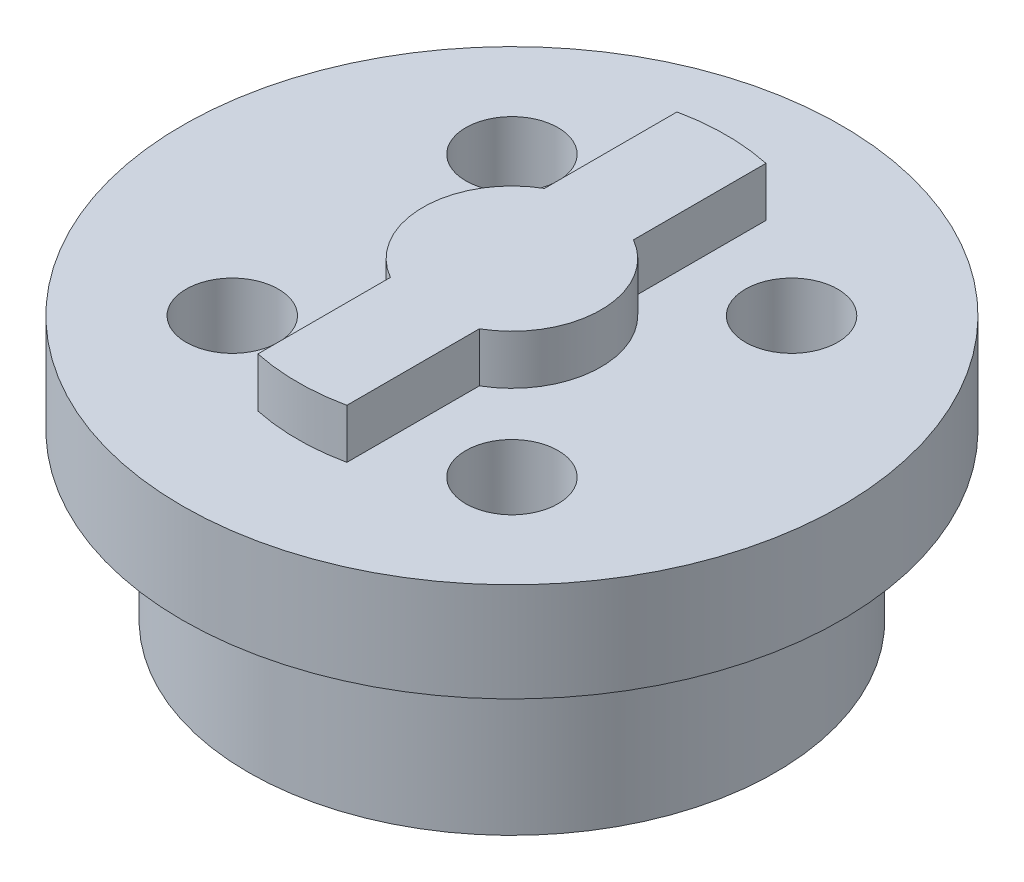
ISO-10303-21;
HEADER;
FILE_DESCRIPTION(('STEP AP214'),'2;1');
FILE_NAME('part.step','',(''),(''),'','','');
FILE_SCHEMA(('AUTOMOTIVE_DESIGN { 1 0 10303 214 1 1 1 1 }'));
ENDSEC;
DATA;
#1=APPLICATION_CONTEXT('core data for automotive mechanical design processes');
#2=APPLICATION_PROTOCOL_DEFINITION('international standard','automotive_design',2000,#1);
#3=PRODUCT_CONTEXT('',#1,'mechanical');
#4=PRODUCT('Part','Part','',(#3));
#5=PRODUCT_RELATED_PRODUCT_CATEGORY('part','',(#4));
#6=PRODUCT_DEFINITION_FORMATION('','',#4);
#7=PRODUCT_DEFINITION_CONTEXT('part definition',#1,'design');
#8=PRODUCT_DEFINITION('design','',#6,#7);
#9=PRODUCT_DEFINITION_SHAPE('','',#8);
#10=(LENGTH_UNIT() NAMED_UNIT(*) SI_UNIT(.MILLI.,.METRE.));
#11=(NAMED_UNIT(*) PLANE_ANGLE_UNIT() SI_UNIT($,.RADIAN.));
#12=(NAMED_UNIT(*) SI_UNIT($,.STERADIAN.) SOLID_ANGLE_UNIT());
#13=UNCERTAINTY_MEASURE_WITH_UNIT(LENGTH_MEASURE(1.E-05),#10,'distance_accuracy_value','');
#14=(GEOMETRIC_REPRESENTATION_CONTEXT(3) GLOBAL_UNCERTAINTY_ASSIGNED_CONTEXT((#13)) GLOBAL_UNIT_ASSIGNED_CONTEXT((#10,
#11,#12)) REPRESENTATION_CONTEXT('',''));
#15=CARTESIAN_POINT('',(0.,0.,0.));
#16=DIRECTION('',(0.,0.,1.));
#17=DIRECTION('',(1.,0.,0.));
#18=AXIS2_PLACEMENT_3D('',#15,#16,#17);
#19=CARTESIAN_POINT('',(0.,8.,0.));
#20=DIRECTION('',(0.,-1.,0.));
#21=DIRECTION('',(0.,0.,-1.));
#22=AXIS2_PLACEMENT_3D('',#19,#20,#21);
#23=CYLINDRICAL_SURFACE('',#22,10.);
#24=CARTESIAN_POINT('',(0.,5.,0.));
#25=DIRECTION('',(0.,1.,0.));
#26=DIRECTION('',(0.,0.,1.));
#27=AXIS2_PLACEMENT_3D('',#24,#25,#26);
#28=CIRCLE('',#27,10.);
#29=CARTESIAN_POINT('',(0.,5.,10.));
#30=VERTEX_POINT('',#29);
#31=EDGE_CURVE('E186',#30,#30,#28,.T.);
#32=ORIENTED_EDGE('',*,*,#31,.T.);
#33=EDGE_LOOP('',(#32));
#34=FACE_BOUND('',#33,.T.);
#35=CARTESIAN_POINT('',(0.,8.,0.));
#36=DIRECTION('',(0.,1.,0.));
#37=DIRECTION('',(0.,0.,1.));
#38=AXIS2_PLACEMENT_3D('',#35,#36,#37);
#39=CIRCLE('',#38,10.);
#40=CARTESIAN_POINT('',(0.,8.,10.));
#41=VERTEX_POINT('',#40);
#42=EDGE_CURVE('E12',#41,#41,#39,.T.);
#43=ORIENTED_EDGE('',*,*,#42,.F.);
#44=EDGE_LOOP('',(#43));
#45=FACE_BOUND('',#44,.T.);
#46=ADVANCED_FACE('F47',(#34,#45),#23,.T.);
#47=CARTESIAN_POINT('',(0.,8.,0.));
#48=DIRECTION('',(0.,1.,0.));
#49=DIRECTION('',(0.,0.,1.));
#50=AXIS2_PLACEMENT_3D('',#47,#48,#49);
#51=PLANE('',#50);
#52=CARTESIAN_POINT('',(4.24264068711928,8.,-4.24264068711929));
#53=DIRECTION('',(0.,1.,0.));
#54=DIRECTION('',(0.,0.,1.));
#55=AXIS2_PLACEMENT_3D('',#52,#53,#54);
#56=CIRCLE('',#55,1.4);
#57=CARTESIAN_POINT('',(4.24264068711928,8.,-2.84264068711929));
#58=VERTEX_POINT('',#57);
#59=EDGE_CURVE('E239',#58,#58,#56,.F.);
#60=ORIENTED_EDGE('',*,*,#59,.T.);
#61=EDGE_LOOP('',(#60));
#62=FACE_BOUND('',#61,.T.);
#63=CARTESIAN_POINT('',(-4.24264068711928,8.,-4.24264068711929));
#64=DIRECTION('',(0.,1.,0.));
#65=DIRECTION('',(0.,0.,1.));
#66=AXIS2_PLACEMENT_3D('',#63,#64,#65);
#67=CIRCLE('',#66,1.4);
#68=CARTESIAN_POINT('',(-4.24264068711928,8.,-2.84264068711929));
#69=VERTEX_POINT('',#68);
#70=EDGE_CURVE('E231',#69,#69,#67,.F.);
#71=ORIENTED_EDGE('',*,*,#70,.T.);
#72=EDGE_LOOP('',(#71));
#73=FACE_BOUND('',#72,.T.);
#74=CARTESIAN_POINT('',(-4.24264068711925,8.,4.24264068711932));
#75=DIRECTION('',(0.,1.,0.));
#76=DIRECTION('',(0.,0.,1.));
#77=AXIS2_PLACEMENT_3D('',#74,#75,#76);
#78=CIRCLE('',#77,1.4);
#79=CARTESIAN_POINT('',(-4.24264068711925,8.,5.64264068711932));
#80=VERTEX_POINT('',#79);
#81=EDGE_CURVE('E223',#80,#80,#78,.F.);
#82=ORIENTED_EDGE('',*,*,#81,.T.);
#83=EDGE_LOOP('',(#82));
#84=FACE_BOUND('',#83,.T.);
#85=CARTESIAN_POINT('',(4.24264068711928,8.,4.24264068711929));
#86=DIRECTION('',(0.,1.,0.));
#87=DIRECTION('',(0.,0.,1.));
#88=AXIS2_PLACEMENT_3D('',#85,#86,#87);
#89=CIRCLE('',#88,1.4);
#90=CARTESIAN_POINT('',(4.24264068711928,8.,5.64264068711929));
#91=VERTEX_POINT('',#90);
#92=EDGE_CURVE('E215',#91,#91,#89,.F.);
#93=ORIENTED_EDGE('',*,*,#92,.T.);
#94=EDGE_LOOP('',(#93));
#95=FACE_BOUND('',#94,.T.);
#96=CARTESIAN_POINT('',(0.,8.,0.));
#97=DIRECTION('',(0.,1.,0.));
#98=DIRECTION('',(0.,0.,-1.));
#99=AXIS2_PLACEMENT_3D('',#96,#97,#98);
#100=CIRCLE('',#99,6.5);
#101=CARTESIAN_POINT('',(1.35,8.,-6.35826234123758));
#102=VERTEX_POINT('',#101);
#103=CARTESIAN_POINT('',(-1.35,8.,-6.35826234123758));
#104=VERTEX_POINT('',#103);
#105=EDGE_CURVE('E62',#102,#104,#100,.T.);
#106=ORIENTED_EDGE('',*,*,#105,.F.);
#107=DIRECTION('',(0.,0.,-1.));
#108=VECTOR('',#107,1.);
#109=CARTESIAN_POINT('',(1.35,8.,-2.33826859021798));
#110=LINE('',#109,#108);
#111=CARTESIAN_POINT('',(1.35,8.,-2.33826859021798));
#112=VERTEX_POINT('',#111);
#113=EDGE_CURVE('E66',#112,#102,#110,.T.);
#114=ORIENTED_EDGE('',*,*,#113,.F.);
#115=CARTESIAN_POINT('',(0.,8.,0.));
#116=DIRECTION('',(0.,1.,0.));
#117=DIRECTION('',(0.,0.,1.));
#118=AXIS2_PLACEMENT_3D('',#115,#116,#117);
#119=CIRCLE('',#118,2.7);
#120=CARTESIAN_POINT('',(1.35,8.,2.33826859021798));
#121=VERTEX_POINT('',#120);
#122=EDGE_CURVE('E162',#121,#112,#119,.T.);
#123=ORIENTED_EDGE('',*,*,#122,.F.);
#124=DIRECTION('',(0.,0.,-1.));
#125=VECTOR('',#124,1.);
#126=CARTESIAN_POINT('',(1.35,8.,2.33826859021798));
#127=LINE('',#126,#125);
#128=CARTESIAN_POINT('',(1.35,8.,6.35826234123758));
#129=VERTEX_POINT('',#128);
#130=EDGE_CURVE('E165',#129,#121,#127,.T.);
#131=ORIENTED_EDGE('',*,*,#130,.F.);
#132=CARTESIAN_POINT('',(0.,8.,0.));
#133=DIRECTION('',(0.,1.,0.));
#134=DIRECTION('',(0.,0.,1.));
#135=AXIS2_PLACEMENT_3D('',#132,#133,#134);
#136=CIRCLE('',#135,6.5);
#137=CARTESIAN_POINT('',(-1.35,8.,6.35826234123758));
#138=VERTEX_POINT('',#137);
#139=EDGE_CURVE('E169',#138,#129,#136,.T.);
#140=ORIENTED_EDGE('',*,*,#139,.F.);
#141=DIRECTION('',(0.,0.,1.));
#142=VECTOR('',#141,1.);
#143=CARTESIAN_POINT('',(-1.35,8.,2.33826859021798));
#144=LINE('',#143,#142);
#145=CARTESIAN_POINT('',(-1.35,8.,2.33826859021798));
#146=VERTEX_POINT('',#145);
#147=EDGE_CURVE('E173',#146,#138,#144,.T.);
#148=ORIENTED_EDGE('',*,*,#147,.F.);
#149=CARTESIAN_POINT('',(0.,8.,0.));
#150=DIRECTION('',(0.,1.,0.));
#151=DIRECTION('',(0.,0.,1.));
#152=AXIS2_PLACEMENT_3D('',#149,#150,#151);
#153=CIRCLE('',#152,2.7);
#154=CARTESIAN_POINT('',(-1.35,8.,-2.33826859021798));
#155=VERTEX_POINT('',#154);
#156=EDGE_CURVE('E177',#155,#146,#153,.T.);
#157=ORIENTED_EDGE('',*,*,#156,.F.);
#158=DIRECTION('',(0.,0.,1.));
#159=VECTOR('',#158,1.);
#160=CARTESIAN_POINT('',(-1.35,8.,-6.35826234123758));
#161=LINE('',#160,#159);
#162=EDGE_CURVE('E181',#104,#155,#161,.T.);
#163=ORIENTED_EDGE('',*,*,#162,.F.);
#164=EDGE_LOOP('',(#106,#114,#123,#131,#140,#148,#157,#163));
#165=FACE_BOUND('',#164,.T.);
#166=ORIENTED_EDGE('',*,*,#42,.T.);
#167=EDGE_LOOP('',(#166));
#168=FACE_BOUND('',#167,.T.);
#169=ADVANCED_FACE('F275',(#62,#73,#84,#95,#165,#168),#51,.T.);
#170=CARTESIAN_POINT('',(0.,9.5,0.));
#171=DIRECTION('',(0.,-1.,0.));
#172=DIRECTION('',(0.,0.,-1.));
#173=AXIS2_PLACEMENT_3D('',#170,#171,#172);
#174=CYLINDRICAL_SURFACE('',#173,6.5);
#175=ORIENTED_EDGE('',*,*,#105,.T.);
#176=DIRECTION('',(0.,-1.,0.));
#177=VECTOR('',#176,1.);
#178=CARTESIAN_POINT('',(-1.35,9.5,-6.35826234123758));
#179=LINE('',#178,#177);
#180=CARTESIAN_POINT('',(-1.35,9.5,-6.35826234123758));
#181=VERTEX_POINT('',#180);
#182=EDGE_CURVE('E55',#181,#104,#179,.T.);
#183=ORIENTED_EDGE('',*,*,#182,.F.);
#184=CARTESIAN_POINT('',(0.,9.5,0.));
#185=DIRECTION('',(0.,1.,0.));
#186=DIRECTION('',(0.,0.,-1.));
#187=AXIS2_PLACEMENT_3D('',#184,#185,#186);
#188=CIRCLE('',#187,6.5);
#189=CARTESIAN_POINT('',(1.35,9.5,-6.35826234123758));
#190=VERTEX_POINT('',#189);
#191=EDGE_CURVE('E121',#190,#181,#188,.T.);
#192=ORIENTED_EDGE('',*,*,#191,.F.);
#193=DIRECTION('',(0.,-1.,0.));
#194=VECTOR('',#193,1.);
#195=CARTESIAN_POINT('',(1.35,9.5,-6.35826234123758));
#196=LINE('',#195,#194);
#197=EDGE_CURVE('E157',#190,#102,#196,.T.);
#198=ORIENTED_EDGE('',*,*,#197,.T.);
#199=EDGE_LOOP('',(#175,#183,#192,#198));
#200=FACE_BOUND('',#199,.T.);
#201=ADVANCED_FACE('F132',(#200),#174,.T.);
#202=CARTESIAN_POINT('',(-1.35,9.5,-6.35826234123758));
#203=DIRECTION('',(1.,0.,0.));
#204=DIRECTION('',(0.,0.,-1.));
#205=AXIS2_PLACEMENT_3D('',#202,#203,#204);
#206=PLANE('',#205);
#207=ORIENTED_EDGE('',*,*,#162,.T.);
#208=DIRECTION('',(0.,-1.,0.));
#209=VECTOR('',#208,1.);
#210=CARTESIAN_POINT('',(-1.35,9.5,-2.33826859021798));
#211=LINE('',#210,#209);
#212=CARTESIAN_POINT('',(-1.35,9.5,-2.33826859021798));
#213=VERTEX_POINT('',#212);
#214=EDGE_CURVE('E116',#213,#155,#211,.T.);
#215=ORIENTED_EDGE('',*,*,#214,.F.);
#216=DIRECTION('',(0.,0.,1.));
#217=VECTOR('',#216,1.);
#218=CARTESIAN_POINT('',(-1.35,9.5,-6.35826234123758));
#219=LINE('',#218,#217);
#220=EDGE_CURVE('E110',#181,#213,#219,.T.);
#221=ORIENTED_EDGE('',*,*,#220,.F.);
#222=ORIENTED_EDGE('',*,*,#182,.T.);
#223=EDGE_LOOP('',(#207,#215,#221,#222));
#224=FACE_BOUND('',#223,.T.);
#225=ADVANCED_FACE('F113',(#224),#206,.F.);
#226=CARTESIAN_POINT('',(0.,9.5,0.));
#227=DIRECTION('',(0.,-1.,0.));
#228=DIRECTION('',(0.,0.,-1.));
#229=AXIS2_PLACEMENT_3D('',#226,#227,#228);
#230=CYLINDRICAL_SURFACE('',#229,2.7);
#231=ORIENTED_EDGE('',*,*,#156,.T.);
#232=DIRECTION('',(0.,-1.,0.));
#233=VECTOR('',#232,1.);
#234=CARTESIAN_POINT('',(-1.35,9.5,2.33826859021798));
#235=LINE('',#234,#233);
#236=CARTESIAN_POINT('',(-1.35,9.5,2.33826859021798));
#237=VERTEX_POINT('',#236);
#238=EDGE_CURVE('E135',#237,#146,#235,.T.);
#239=ORIENTED_EDGE('',*,*,#238,.F.);
#240=CARTESIAN_POINT('',(0.,9.5,0.));
#241=DIRECTION('',(0.,1.,0.));
#242=DIRECTION('',(0.,0.,1.));
#243=AXIS2_PLACEMENT_3D('',#240,#241,#242);
#244=CIRCLE('',#243,2.7);
#245=EDGE_CURVE('E120',#213,#237,#244,.T.);
#246=ORIENTED_EDGE('',*,*,#245,.F.);
#247=ORIENTED_EDGE('',*,*,#214,.T.);
#248=EDGE_LOOP('',(#231,#239,#246,#247));
#249=FACE_BOUND('',#248,.T.);
#250=ADVANCED_FACE('F289',(#249),#230,.T.);
#251=CARTESIAN_POINT('',(-1.35,9.5,2.33826859021798));
#252=DIRECTION('',(1.,0.,0.));
#253=DIRECTION('',(0.,0.,-1.));
#254=AXIS2_PLACEMENT_3D('',#251,#252,#253);
#255=PLANE('',#254);
#256=ORIENTED_EDGE('',*,*,#147,.T.);
#257=DIRECTION('',(0.,-1.,0.));
#258=VECTOR('',#257,1.);
#259=CARTESIAN_POINT('',(-1.35,9.5,6.35826234123758));
#260=LINE('',#259,#258);
#261=CARTESIAN_POINT('',(-1.35,9.5,6.35826234123758));
#262=VERTEX_POINT('',#261);
#263=EDGE_CURVE('E141',#262,#138,#260,.T.);
#264=ORIENTED_EDGE('',*,*,#263,.F.);
#265=DIRECTION('',(0.,0.,1.));
#266=VECTOR('',#265,1.);
#267=CARTESIAN_POINT('',(-1.35,9.5,2.33826859021798));
#268=LINE('',#267,#266);
#269=EDGE_CURVE('E198',#237,#262,#268,.T.);
#270=ORIENTED_EDGE('',*,*,#269,.F.);
#271=ORIENTED_EDGE('',*,*,#238,.T.);
#272=EDGE_LOOP('',(#256,#264,#270,#271));
#273=FACE_BOUND('',#272,.T.);
#274=ADVANCED_FACE('F292',(#273),#255,.F.);
#275=CARTESIAN_POINT('',(0.,9.5,0.));
#276=DIRECTION('',(0.,-1.,0.));
#277=DIRECTION('',(0.,0.,-1.));
#278=AXIS2_PLACEMENT_3D('',#275,#276,#277);
#279=CYLINDRICAL_SURFACE('',#278,6.5);
#280=ORIENTED_EDGE('',*,*,#139,.T.);
#281=DIRECTION('',(0.,-1.,0.));
#282=VECTOR('',#281,1.);
#283=CARTESIAN_POINT('',(1.35,9.5,6.35826234123758));
#284=LINE('',#283,#282);
#285=CARTESIAN_POINT('',(1.35,9.5,6.35826234123758));
#286=VERTEX_POINT('',#285);
#287=EDGE_CURVE('E145',#286,#129,#284,.T.);
#288=ORIENTED_EDGE('',*,*,#287,.F.);
#289=CARTESIAN_POINT('',(0.,9.5,0.));
#290=DIRECTION('',(0.,1.,0.));
#291=DIRECTION('',(0.,0.,1.));
#292=AXIS2_PLACEMENT_3D('',#289,#290,#291);
#293=CIRCLE('',#292,6.5);
#294=EDGE_CURVE('E195',#262,#286,#293,.T.);
#295=ORIENTED_EDGE('',*,*,#294,.F.);
#296=ORIENTED_EDGE('',*,*,#263,.T.);
#297=EDGE_LOOP('',(#280,#288,#295,#296));
#298=FACE_BOUND('',#297,.T.);
#299=ADVANCED_FACE('F296',(#298),#279,.T.);
#300=CARTESIAN_POINT('',(1.35,9.5,2.33826859021798));
#301=DIRECTION('',(-1.,0.,0.));
#302=DIRECTION('',(0.,0.,1.));
#303=AXIS2_PLACEMENT_3D('',#300,#301,#302);
#304=PLANE('',#303);
#305=ORIENTED_EDGE('',*,*,#130,.T.);
#306=DIRECTION('',(0.,-1.,0.));
#307=VECTOR('',#306,1.);
#308=CARTESIAN_POINT('',(1.35,9.5,2.33826859021798));
#309=LINE('',#308,#307);
#310=CARTESIAN_POINT('',(1.35,9.5,2.33826859021798));
#311=VERTEX_POINT('',#310);
#312=EDGE_CURVE('E149',#311,#121,#309,.T.);
#313=ORIENTED_EDGE('',*,*,#312,.F.);
#314=DIRECTION('',(0.,0.,-1.));
#315=VECTOR('',#314,1.);
#316=CARTESIAN_POINT('',(1.35,9.5,2.33826859021798));
#317=LINE('',#316,#315);
#318=EDGE_CURVE('E192',#286,#311,#317,.T.);
#319=ORIENTED_EDGE('',*,*,#318,.F.);
#320=ORIENTED_EDGE('',*,*,#287,.T.);
#321=EDGE_LOOP('',(#305,#313,#319,#320));
#322=FACE_BOUND('',#321,.T.);
#323=ADVANCED_FACE('F300',(#322),#304,.F.);
#324=CARTESIAN_POINT('',(0.,9.5,0.));
#325=DIRECTION('',(0.,-1.,0.));
#326=DIRECTION('',(0.,0.,-1.));
#327=AXIS2_PLACEMENT_3D('',#324,#325,#326);
#328=CYLINDRICAL_SURFACE('',#327,2.7);
#329=ORIENTED_EDGE('',*,*,#122,.T.);
#330=DIRECTION('',(0.,-1.,0.));
#331=VECTOR('',#330,1.);
#332=CARTESIAN_POINT('',(1.35,9.5,-2.33826859021798));
#333=LINE('',#332,#331);
#334=CARTESIAN_POINT('',(1.35,9.5,-2.33826859021798));
#335=VERTEX_POINT('',#334);
#336=EDGE_CURVE('E153',#335,#112,#333,.T.);
#337=ORIENTED_EDGE('',*,*,#336,.F.);
#338=CARTESIAN_POINT('',(0.,9.5,0.));
#339=DIRECTION('',(0.,1.,0.));
#340=DIRECTION('',(0.,0.,1.));
#341=AXIS2_PLACEMENT_3D('',#338,#339,#340);
#342=CIRCLE('',#341,2.7);
#343=EDGE_CURVE('E189',#311,#335,#342,.T.);
#344=ORIENTED_EDGE('',*,*,#343,.F.);
#345=ORIENTED_EDGE('',*,*,#312,.T.);
#346=EDGE_LOOP('',(#329,#337,#344,#345));
#347=FACE_BOUND('',#346,.T.);
#348=ADVANCED_FACE('F304',(#347),#328,.T.);
#349=CARTESIAN_POINT('',(1.35,9.5,-2.33826859021798));
#350=DIRECTION('',(-1.,0.,0.));
#351=DIRECTION('',(0.,0.,1.));
#352=AXIS2_PLACEMENT_3D('',#349,#350,#351);
#353=PLANE('',#352);
#354=ORIENTED_EDGE('',*,*,#113,.T.);
#355=ORIENTED_EDGE('',*,*,#197,.F.);
#356=DIRECTION('',(0.,0.,-1.));
#357=VECTOR('',#356,1.);
#358=CARTESIAN_POINT('',(1.35,9.5,-2.33826859021798));
#359=LINE('',#358,#357);
#360=EDGE_CURVE('E126',#335,#190,#359,.T.);
#361=ORIENTED_EDGE('',*,*,#360,.F.);
#362=ORIENTED_EDGE('',*,*,#336,.T.);
#363=EDGE_LOOP('',(#354,#355,#361,#362));
#364=FACE_BOUND('',#363,.T.);
#365=ADVANCED_FACE('F308',(#364),#353,.F.);
#366=CARTESIAN_POINT('',(0.,9.5,0.));
#367=DIRECTION('',(0.,-1.,0.));
#368=DIRECTION('',(0.,0.,-1.));
#369=AXIS2_PLACEMENT_3D('',#366,#367,#368);
#370=PLANE('',#369);
#371=ORIENTED_EDGE('',*,*,#191,.T.);
#372=ORIENTED_EDGE('',*,*,#220,.T.);
#373=ORIENTED_EDGE('',*,*,#245,.T.);
#374=ORIENTED_EDGE('',*,*,#269,.T.);
#375=ORIENTED_EDGE('',*,*,#294,.T.);
#376=ORIENTED_EDGE('',*,*,#318,.T.);
#377=ORIENTED_EDGE('',*,*,#343,.T.);
#378=ORIENTED_EDGE('',*,*,#360,.T.);
#379=EDGE_LOOP('',(#371,#372,#373,#374,#375,#376,#377,#378));
#380=FACE_BOUND('',#379,.T.);
#381=ADVANCED_FACE('F124',(#380),#370,.F.);
#382=CARTESIAN_POINT('',(0.,36.2842712474619,0.));
#383=DIRECTION('',(0.,-1.,0.));
#384=DIRECTION('',(0.,0.,-1.));
#385=AXIS2_PLACEMENT_3D('',#382,#383,#384);
#386=CYLINDRICAL_SURFACE('',#385,8.);
#387=CARTESIAN_POINT('',(0.,0.,0.));
#388=DIRECTION('',(0.,1.,0.));
#389=DIRECTION('',(0.,0.,1.));
#390=AXIS2_PLACEMENT_3D('',#387,#388,#389);
#391=CIRCLE('',#390,8.);
#392=CARTESIAN_POINT('',(0.,0.,8.));
#393=VERTEX_POINT('',#392);
#394=EDGE_CURVE('E207',#393,#393,#391,.T.);
#395=ORIENTED_EDGE('',*,*,#394,.T.);
#396=EDGE_LOOP('',(#395));
#397=FACE_BOUND('',#396,.T.);
#398=CARTESIAN_POINT('',(0.,5.,0.));
#399=DIRECTION('',(0.,1.,0.));
#400=DIRECTION('',(0.,0.,1.));
#401=AXIS2_PLACEMENT_3D('',#398,#399,#400);
#402=CIRCLE('',#401,8.);
#403=CARTESIAN_POINT('',(0.,5.,8.));
#404=VERTEX_POINT('',#403);
#405=EDGE_CURVE('E203',#404,#404,#402,.T.);
#406=ORIENTED_EDGE('',*,*,#405,.F.);
#407=EDGE_LOOP('',(#406));
#408=FACE_BOUND('',#407,.T.);
#409=ADVANCED_FACE('F262',(#397,#408),#386,.T.);
#410=CARTESIAN_POINT('',(0.,5.,0.));
#411=DIRECTION('',(0.,1.,0.));
#412=DIRECTION('',(0.,0.,1.));
#413=AXIS2_PLACEMENT_3D('',#410,#411,#412);
#414=PLANE('',#413);
#415=ORIENTED_EDGE('',*,*,#405,.T.);
#416=EDGE_LOOP('',(#415));
#417=FACE_BOUND('',#416,.T.);
#418=ORIENTED_EDGE('',*,*,#31,.F.);
#419=EDGE_LOOP('',(#418));
#420=FACE_BOUND('',#419,.T.);
#421=ADVANCED_FACE('F253',(#417,#420),#414,.F.);
#422=CARTESIAN_POINT('',(0.,0.,0.));
#423=DIRECTION('',(0.,1.,0.));
#424=DIRECTION('',(0.,0.,1.));
#425=AXIS2_PLACEMENT_3D('',#422,#423,#424);
#426=PLANE('',#425);
#427=CARTESIAN_POINT('',(4.24264068711928,0.,-4.24264068711929));
#428=DIRECTION('',(0.,-1.,0.));
#429=DIRECTION('',(-1.,0.,0.));
#430=AXIS2_PLACEMENT_3D('',#427,#428,#429);
#431=CIRCLE('',#430,1.4);
#432=CARTESIAN_POINT('',(2.84264068711928,0.,-4.24264068711929));
#433=VERTEX_POINT('',#432);
#434=EDGE_CURVE('E219',#433,#433,#431,.T.);
#435=ORIENTED_EDGE('',*,*,#434,.F.);
#436=EDGE_LOOP('',(#435));
#437=FACE_BOUND('',#436,.T.);
#438=CARTESIAN_POINT('',(-4.24264068711928,0.,-4.24264068711929));
#439=DIRECTION('',(0.,-1.,0.));
#440=DIRECTION('',(0.,0.,1.));
#441=AXIS2_PLACEMENT_3D('',#438,#439,#440);
#442=CIRCLE('',#441,1.4);
#443=CARTESIAN_POINT('',(-4.24264068711928,0.,-2.84264068711929));
#444=VERTEX_POINT('',#443);
#445=EDGE_CURVE('E235',#444,#444,#442,.T.);
#446=ORIENTED_EDGE('',*,*,#445,.F.);
#447=EDGE_LOOP('',(#446));
#448=FACE_BOUND('',#447,.T.);
#449=CARTESIAN_POINT('',(-4.24264068711925,0.,4.24264068711932));
#450=DIRECTION('',(0.,-1.,0.));
#451=DIRECTION('',(1.,0.,0.));
#452=AXIS2_PLACEMENT_3D('',#449,#450,#451);
#453=CIRCLE('',#452,1.4);
#454=CARTESIAN_POINT('',(-2.84264068711925,0.,4.24264068711931));
#455=VERTEX_POINT('',#454);
#456=EDGE_CURVE('E227',#455,#455,#453,.T.);
#457=ORIENTED_EDGE('',*,*,#456,.F.);
#458=EDGE_LOOP('',(#457));
#459=FACE_BOUND('',#458,.T.);
#460=CARTESIAN_POINT('',(4.24264068711928,0.,4.24264068711929));
#461=DIRECTION('',(0.,-1.,0.));
#462=DIRECTION('',(0.,0.,-1.));
#463=AXIS2_PLACEMENT_3D('',#460,#461,#462);
#464=CIRCLE('',#463,1.4);
#465=CARTESIAN_POINT('',(4.24264068711928,0.,2.84264068711929));
#466=VERTEX_POINT('',#465);
#467=EDGE_CURVE('E208',#466,#466,#464,.T.);
#468=ORIENTED_EDGE('',*,*,#467,.F.);
#469=EDGE_LOOP('',(#468));
#470=FACE_BOUND('',#469,.T.);
#471=ORIENTED_EDGE('',*,*,#394,.F.);
#472=EDGE_LOOP('',(#471));
#473=FACE_BOUND('',#472,.T.);
#474=ADVANCED_FACE('F249',(#437,#448,#459,#470,#473),#426,.F.);
#475=CARTESIAN_POINT('',(4.24264068711928,9.501,4.24264068711929));
#476=DIRECTION('',(0.,-1.,0.));
#477=DIRECTION('',(0.,0.,-1.));
#478=AXIS2_PLACEMENT_3D('',#475,#476,#477);
#479=CYLINDRICAL_SURFACE('',#478,1.4);
#480=ORIENTED_EDGE('',*,*,#92,.F.);
#481=EDGE_LOOP('',(#480));
#482=FACE_BOUND('',#481,.T.);
#483=ORIENTED_EDGE('',*,*,#467,.T.);
#484=EDGE_LOOP('',(#483));
#485=FACE_BOUND('',#484,.T.);
#486=ADVANCED_FACE('F252',(#482,#485),#479,.F.);
#487=CARTESIAN_POINT('',(-4.24264068711925,9.501,4.24264068711932));
#488=DIRECTION('',(0.,-1.,0.));
#489=DIRECTION('',(0.,0.,-1.));
#490=AXIS2_PLACEMENT_3D('',#487,#488,#489);
#491=CYLINDRICAL_SURFACE('',#490,1.4);
#492=ORIENTED_EDGE('',*,*,#81,.F.);
#493=EDGE_LOOP('',(#492));
#494=FACE_BOUND('',#493,.T.);
#495=ORIENTED_EDGE('',*,*,#456,.T.);
#496=EDGE_LOOP('',(#495));
#497=FACE_BOUND('',#496,.T.);
#498=ADVANCED_FACE('F317',(#494,#497),#491,.F.);
#499=CARTESIAN_POINT('',(-4.24264068711928,9.501,-4.24264068711929));
#500=DIRECTION('',(0.,-1.,0.));
#501=DIRECTION('',(0.,0.,-1.));
#502=AXIS2_PLACEMENT_3D('',#499,#500,#501);
#503=CYLINDRICAL_SURFACE('',#502,1.4);
#504=ORIENTED_EDGE('',*,*,#70,.F.);
#505=EDGE_LOOP('',(#504));
#506=FACE_BOUND('',#505,.T.);
#507=ORIENTED_EDGE('',*,*,#445,.T.);
#508=EDGE_LOOP('',(#507));
#509=FACE_BOUND('',#508,.T.);
#510=ADVANCED_FACE('F321',(#506,#509),#503,.F.);
#511=CARTESIAN_POINT('',(4.24264068711928,9.501,-4.24264068711929));
#512=DIRECTION('',(0.,-1.,0.));
#513=DIRECTION('',(0.,0.,-1.));
#514=AXIS2_PLACEMENT_3D('',#511,#512,#513);
#515=CYLINDRICAL_SURFACE('',#514,1.4);
#516=ORIENTED_EDGE('',*,*,#59,.F.);
#517=EDGE_LOOP('',(#516));
#518=FACE_BOUND('',#517,.T.);
#519=ORIENTED_EDGE('',*,*,#434,.T.);
#520=EDGE_LOOP('',(#519));
#521=FACE_BOUND('',#520,.T.);
#522=ADVANCED_FACE('F247',(#518,#521),#515,.F.);
#523=CLOSED_SHELL('',(#46,#169,#201,#225,#250,#274,#299,#323,#348,#365,#381,#409,#421,#474,#486,
#498,#510,#522));
#524=MANIFOLD_SOLID_BREP('B2',#523);
#525=ADVANCED_BREP_SHAPE_REPRESENTATION('',(#18,#524),#14);
#526=SHAPE_DEFINITION_REPRESENTATION(#9,#525);
ENDSEC;
END-ISO-10303-21;
